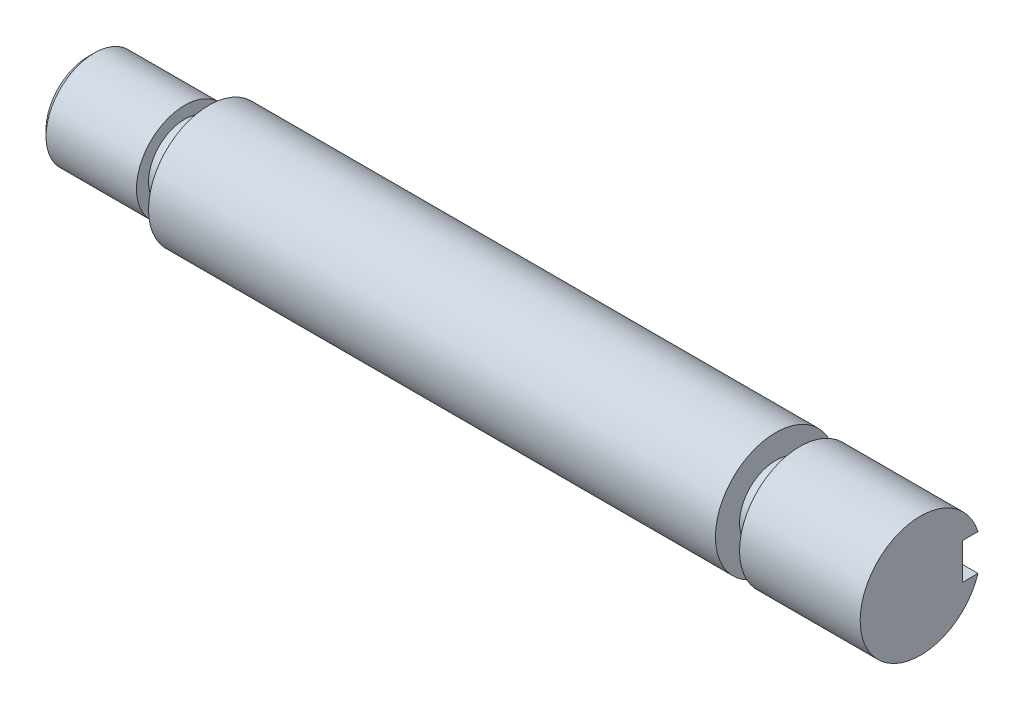
ISO-10303-21;
HEADER;
FILE_DESCRIPTION(('STEP AP214'),'2;1');
FILE_NAME('part.step','',(''),(''),'','','');
FILE_SCHEMA(('AUTOMOTIVE_DESIGN { 1 0 10303 214 1 1 1 1 }'));
ENDSEC;
DATA;
#1=APPLICATION_CONTEXT('core data for automotive mechanical design processes');
#2=APPLICATION_PROTOCOL_DEFINITION('international standard','automotive_design',2000,#1);
#3=PRODUCT_CONTEXT('',#1,'mechanical');
#4=PRODUCT('Part','Part','',(#3));
#5=PRODUCT_RELATED_PRODUCT_CATEGORY('part','',(#4));
#6=PRODUCT_DEFINITION_FORMATION('','',#4);
#7=PRODUCT_DEFINITION_CONTEXT('part definition',#1,'design');
#8=PRODUCT_DEFINITION('design','',#6,#7);
#9=PRODUCT_DEFINITION_SHAPE('','',#8);
#10=(LENGTH_UNIT() NAMED_UNIT(*) SI_UNIT(.MILLI.,.METRE.));
#11=(NAMED_UNIT(*) PLANE_ANGLE_UNIT() SI_UNIT($,.RADIAN.));
#12=(NAMED_UNIT(*) SI_UNIT($,.STERADIAN.) SOLID_ANGLE_UNIT());
#13=UNCERTAINTY_MEASURE_WITH_UNIT(LENGTH_MEASURE(1.E-05),#10,'distance_accuracy_value','');
#14=(GEOMETRIC_REPRESENTATION_CONTEXT(3) GLOBAL_UNCERTAINTY_ASSIGNED_CONTEXT((#13)) GLOBAL_UNIT_ASSIGNED_CONTEXT((#10,
#11,#12)) REPRESENTATION_CONTEXT('',''));
#15=CARTESIAN_POINT('',(0.,0.,0.));
#16=DIRECTION('',(0.,0.,1.));
#17=DIRECTION('',(1.,0.,0.));
#18=AXIS2_PLACEMENT_3D('',#15,#16,#17);
#19=CARTESIAN_POINT('',(34.5,0.,0.));
#20=DIRECTION('',(-1.,0.,0.));
#21=DIRECTION('',(0.,0.,1.));
#22=AXIS2_PLACEMENT_3D('',#19,#20,#21);
#23=CYLINDRICAL_SURFACE('',#22,5.);
#24=CARTESIAN_POINT('',(9.,1.5,-4.76969600708473));
#25=CARTESIAN_POINT('',(8.95882060709199,1.5000008535707,-4.76969249084934));
#26=CARTESIAN_POINT('',(8.91766195687388,1.49830317083427,-4.77022997000129));
#27=CARTESIAN_POINT('',(8.83565883790444,1.49153785660316,-4.77235095109999));
#28=CARTESIAN_POINT('',(8.79481430060511,1.48647098275841,-4.77393421787376));
#29=CARTESIAN_POINT('',(8.67340945904534,1.46630203689311,-4.78018490618873));
#30=CARTESIAN_POINT('',(8.59369360958363,1.44623120413662,-4.78635370384275));
#31=CARTESIAN_POINT('',(8.43896442161414,1.39353102315626,-4.80195952113208));
#32=CARTESIAN_POINT('',(8.36394944780192,1.36090607068203,-4.81139539670393));
#33=CARTESIAN_POINT('',(8.2204033184024,1.28407841117655,-4.83246571212052));
#34=CARTESIAN_POINT('',(8.15187520027157,1.23987031651226,-4.84410117434933));
#35=CARTESIAN_POINT('',(8.02113394400295,1.13964850658326,-4.86866835244721));
#36=CARTESIAN_POINT('',(7.9591563396566,1.08333433465208,-4.88162755412974));
#37=CARTESIAN_POINT('',(7.84536441610004,0.961138919873351,-4.90714811559049));
#38=CARTESIAN_POINT('',(7.79355181399695,0.895256063916345,-4.91970940785249));
#39=CARTESIAN_POINT('',(7.70053622968151,0.754109921315427,-4.94333239727705));
#40=CARTESIAN_POINT('',(7.65957481970205,0.678680819336256,-4.95435770971354));
#41=CARTESIAN_POINT('',(7.59101158838185,0.521621185505772,-4.97334469846208));
#42=CARTESIAN_POINT('',(7.56340632220572,0.439992259012925,-4.98130716463903));
#43=CARTESIAN_POINT('',(7.52312020089795,0.275324697874876,-4.99307639935002));
#44=CARTESIAN_POINT('',(7.51003514203026,0.192393125294252,-4.99699549276993));
#45=CARTESIAN_POINT('',(7.49788265863674,0.0254235719980797,-5.00063202022426));
#46=CARTESIAN_POINT('',(7.49881258029984,-0.0586141962423644,-5.00035024971471));
#47=CARTESIAN_POINT('',(7.514392908759,-0.222571599946019,-4.99569602566267));
#48=CARTESIAN_POINT('',(7.52860534497872,-0.302537145464643,-4.99145415509187));
#49=CARTESIAN_POINT('',(7.56963163523811,-0.458890052102027,-4.9795151369998));
#50=CARTESIAN_POINT('',(7.59644614945594,-0.535277225531999,-4.97181780846028));
#51=CARTESIAN_POINT('',(7.66221222164644,-0.683347815892218,-4.95365214926145));
#52=CARTESIAN_POINT('',(7.70130164435694,-0.754966006044144,-4.94315255692525));
#53=CARTESIAN_POINT('',(7.79039859004832,-0.890765529574422,-4.92049624651755));
#54=CARTESIAN_POINT('',(7.84040855947883,-0.954945191614597,-4.90833915735884));
#55=CARTESIAN_POINT('',(7.95219198808351,-1.07665450541275,-4.88311673571409));
#56=CARTESIAN_POINT('',(8.01434386376074,-1.13383351478034,-4.87003445449554));
#57=CARTESIAN_POINT('',(8.14749742342792,-1.23706769492487,-4.84484215114658));
#58=CARTESIAN_POINT('',(8.21850168036552,-1.28311962013078,-4.83273241337565));
#59=CARTESIAN_POINT('',(8.36828092844929,-1.36316407240863,-4.81077228795653));
#60=CARTESIAN_POINT('',(8.4471271795934,-1.39703006341135,-4.80094596245948));
#61=CARTESIAN_POINT('',(8.60972450398174,-1.45085886004699,-4.78495663653201));
#62=CARTESIAN_POINT('',(8.69346786071437,-1.47084293218036,-4.77878803475875));
#63=CARTESIAN_POINT('',(8.81499488907019,-1.4890120359008,-4.77314032325006));
#64=CARTESIAN_POINT('',(8.85189073417961,-1.49313202989009,-4.77185156275267));
#65=CARTESIAN_POINT('',(8.92585147909953,-1.49862355614854,-4.77012928611782));
#66=CARTESIAN_POINT('',(8.96291604966386,-1.49999912968269,-4.76969451246644));
#67=CARTESIAN_POINT('',(9.,-1.5,-4.76969600708473));
#68=B_SPLINE_CURVE_WITH_KNOTS('',3,(#24,#25,#26,#27,#28,#29,#30,#31,#32,#33,#34,#35,#36,#37,#38,
#39,#40,#41,#42,#43,#44,#45,#46,#47,#48,#49,#50,#51,#52,#53,#54,#55,#56,#57,#58,#59,#60,#61,#62,
#63,#64,#65,#66,#67),.UNSPECIFIED.,.F.,.F.,(4,2,2,2,2,2,2,2,2,2,2,2,2,2,2,2,2,2,2,2,2,4),(0.,
0.123459071219734,0.246890388853043,0.49291134961521,0.738846245884323,0.984895736828092,
1.23795510798803,1.49105719006936,1.74939356197455,2.00766326783256,2.25854751319802,
2.5093842528947,2.75223130012966,2.99509107067835,3.2407824256273,3.48652887757005,
3.74172568310981,3.99699683536777,4.25484698071527,4.51230123440207,4.62365084745809,
4.73483637253615),.UNSPECIFIED.);
#69=CARTESIAN_POINT('',(9.,1.5,-4.76969600708473));
#70=VERTEX_POINT('',#69);
#71=CARTESIAN_POINT('',(9.,-1.5,-4.76969600708473));
#72=VERTEX_POINT('',#71);
#73=EDGE_CURVE('E123',#70,#72,#68,.T.);
#74=ORIENTED_EDGE('',*,*,#73,.T.);
#75=DIRECTION('',(-1.,0.,0.));
#76=VECTOR('',#75,1.);
#77=CARTESIAN_POINT('',(34.5,-1.5,-4.76969600708473));
#78=LINE('',#77,#76);
#79=CARTESIAN_POINT('',(22.5,-1.5,-4.76969600708473));
#80=VERTEX_POINT('',#79);
#81=EDGE_CURVE('E171',#72,#80,#78,.F.);
#82=ORIENTED_EDGE('',*,*,#81,.T.);
#83=CARTESIAN_POINT('',(22.5,0.,0.));
#84=DIRECTION('',(1.,0.,0.));
#85=DIRECTION('',(0.,0.,-1.));
#86=AXIS2_PLACEMENT_3D('',#83,#84,#85);
#87=CIRCLE('',#86,5.);
#88=CARTESIAN_POINT('',(22.5,1.5,-4.76969600708473));
#89=VERTEX_POINT('',#88);
#90=EDGE_CURVE('E191',#89,#80,#87,.T.);
#91=ORIENTED_EDGE('',*,*,#90,.F.);
#92=DIRECTION('',(-1.,0.,0.));
#93=VECTOR('',#92,1.);
#94=CARTESIAN_POINT('',(34.5,1.5,-4.76969600708473));
#95=LINE('',#94,#93);
#96=EDGE_CURVE('E158',#89,#70,#95,.T.);
#97=ORIENTED_EDGE('',*,*,#96,.T.);
#98=EDGE_LOOP('',(#74,#82,#91,#97));
#99=FACE_BOUND('',#98,.T.);
#100=CARTESIAN_POINT('',(-24.5,0.,0.));
#101=DIRECTION('',(-1.,0.,0.));
#102=DIRECTION('',(0.,0.,1.));
#103=AXIS2_PLACEMENT_3D('',#100,#101,#102);
#104=CIRCLE('',#103,5.);
#105=CARTESIAN_POINT('',(-24.5,0.,5.));
#106=VERTEX_POINT('',#105);
#107=EDGE_CURVE('E52',#106,#106,#104,.T.);
#108=ORIENTED_EDGE('',*,*,#107,.F.);
#109=EDGE_LOOP('',(#108));
#110=FACE_BOUND('',#109,.T.);
#111=ADVANCED_FACE('F47',(#99,#110),#23,.T.);
#112=CARTESIAN_POINT('',(22.5,0.,0.));
#113=DIRECTION('',(1.,0.,0.));
#114=DIRECTION('',(0.,0.,-1.));
#115=AXIS2_PLACEMENT_3D('',#112,#113,#114);
#116=PLANE('',#115);
#117=DIRECTION('',(0.,0.,-1.));
#118=VECTOR('',#117,1.);
#119=CARTESIAN_POINT('',(22.5,-1.5,0.));
#120=LINE('',#119,#118);
#121=CARTESIAN_POINT('',(22.5,-1.5,-3.5));
#122=VERTEX_POINT('',#121);
#123=EDGE_CURVE('E168',#122,#80,#120,.T.);
#124=ORIENTED_EDGE('',*,*,#123,.F.);
#125=DIRECTION('',(0.,-1.,0.));
#126=VECTOR('',#125,1.);
#127=CARTESIAN_POINT('',(22.5,0.,-3.5));
#128=LINE('',#127,#126);
#129=CARTESIAN_POINT('',(22.5,1.5,-3.5));
#130=VERTEX_POINT('',#129);
#131=EDGE_CURVE('E179',#130,#122,#128,.T.);
#132=ORIENTED_EDGE('',*,*,#131,.F.);
#133=DIRECTION('',(0.,0.,1.));
#134=VECTOR('',#133,1.);
#135=CARTESIAN_POINT('',(22.5,1.5,0.));
#136=LINE('',#135,#134);
#137=EDGE_CURVE('E132',#89,#130,#136,.T.);
#138=ORIENTED_EDGE('',*,*,#137,.F.);
#139=ORIENTED_EDGE('',*,*,#90,.T.);
#140=EDGE_LOOP('',(#124,#132,#138,#139));
#141=FACE_BOUND('',#140,.T.);
#142=CARTESIAN_POINT('',(22.5,0.,0.));
#143=DIRECTION('',(1.,0.,0.));
#144=DIRECTION('',(0.,0.,-1.));
#145=AXIS2_PLACEMENT_3D('',#142,#143,#144);
#146=CIRCLE('',#145,3.);
#147=CARTESIAN_POINT('',(22.5,0.,-3.));
#148=VERTEX_POINT('',#147);
#149=EDGE_CURVE('E183',#148,#148,#146,.T.);
#150=ORIENTED_EDGE('',*,*,#149,.F.);
#151=EDGE_LOOP('',(#150));
#152=FACE_BOUND('',#151,.T.);
#153=ADVANCED_FACE('F238',(#141,#152),#116,.T.);
#154=CARTESIAN_POINT('',(24.5,0.,0.));
#155=DIRECTION('',(1.,0.,0.));
#156=DIRECTION('',(0.,0.,-1.));
#157=AXIS2_PLACEMENT_3D('',#154,#155,#156);
#158=PLANE('',#157);
#159=CARTESIAN_POINT('',(24.5,0.,0.));
#160=DIRECTION('',(1.,0.,0.));
#161=DIRECTION('',(0.,0.,-1.));
#162=AXIS2_PLACEMENT_3D('',#159,#160,#161);
#163=CIRCLE('',#162,3.);
#164=CARTESIAN_POINT('',(24.5,0.,-3.));
#165=VERTEX_POINT('',#164);
#166=EDGE_CURVE('E182',#165,#165,#163,.T.);
#167=ORIENTED_EDGE('',*,*,#166,.T.);
#168=EDGE_LOOP('',(#167));
#169=FACE_BOUND('',#168,.T.);
#170=DIRECTION('',(0.,-1.,0.));
#171=VECTOR('',#170,1.);
#172=CARTESIAN_POINT('',(24.5,0.,-3.5));
#173=LINE('',#172,#171);
#174=CARTESIAN_POINT('',(24.5,1.5,-3.5));
#175=VERTEX_POINT('',#174);
#176=CARTESIAN_POINT('',(24.5,-1.5,-3.5));
#177=VERTEX_POINT('',#176);
#178=EDGE_CURVE('E175',#175,#177,#173,.T.);
#179=ORIENTED_EDGE('',*,*,#178,.T.);
#180=DIRECTION('',(0.,0.,-1.));
#181=VECTOR('',#180,1.);
#182=CARTESIAN_POINT('',(24.5,-1.5,0.));
#183=LINE('',#182,#181);
#184=CARTESIAN_POINT('',(24.5,-1.5,-4.76969600708473));
#185=VERTEX_POINT('',#184);
#186=EDGE_CURVE('E164',#177,#185,#183,.T.);
#187=ORIENTED_EDGE('',*,*,#186,.T.);
#188=CARTESIAN_POINT('',(24.5,0.,0.));
#189=DIRECTION('',(1.,0.,0.));
#190=DIRECTION('',(0.,0.,-1.));
#191=AXIS2_PLACEMENT_3D('',#188,#189,#190);
#192=CIRCLE('',#191,5.);
#193=CARTESIAN_POINT('',(24.5,1.5,-4.76969600708473));
#194=VERTEX_POINT('',#193);
#195=EDGE_CURVE('E187',#194,#185,#192,.T.);
#196=ORIENTED_EDGE('',*,*,#195,.F.);
#197=DIRECTION('',(0.,0.,1.));
#198=VECTOR('',#197,1.);
#199=CARTESIAN_POINT('',(24.5,1.5,0.));
#200=LINE('',#199,#198);
#201=EDGE_CURVE('E73',#194,#175,#200,.T.);
#202=ORIENTED_EDGE('',*,*,#201,.T.);
#203=EDGE_LOOP('',(#179,#187,#196,#202));
#204=FACE_BOUND('',#203,.T.);
#205=ADVANCED_FACE('F236',(#169,#204),#158,.F.);
#206=CARTESIAN_POINT('',(22.5,0.,0.));
#207=DIRECTION('',(1.,0.,0.));
#208=DIRECTION('',(0.,0.,-1.));
#209=AXIS2_PLACEMENT_3D('',#206,#207,#208);
#210=CYLINDRICAL_SURFACE('',#209,3.);
#211=ORIENTED_EDGE('',*,*,#149,.T.);
#212=EDGE_LOOP('',(#211));
#213=FACE_BOUND('',#212,.T.);
#214=ORIENTED_EDGE('',*,*,#166,.F.);
#215=EDGE_LOOP('',(#214));
#216=FACE_BOUND('',#215,.T.);
#217=ADVANCED_FACE('F232',(#213,#216),#210,.T.);
#218=CARTESIAN_POINT('',(34.5,0.,0.));
#219=DIRECTION('',(1.,0.,0.));
#220=DIRECTION('',(0.,0.,-1.));
#221=AXIS2_PLACEMENT_3D('',#218,#219,#220);
#222=PLANE('',#221);
#223=DIRECTION('',(0.,0.,-1.));
#224=VECTOR('',#223,1.);
#225=CARTESIAN_POINT('',(34.5,-1.5,0.));
#226=LINE('',#225,#224);
#227=CARTESIAN_POINT('',(34.5,-1.5,-3.5));
#228=VERTEX_POINT('',#227);
#229=CARTESIAN_POINT('',(34.5,-1.5,-4.76969600708473));
#230=VERTEX_POINT('',#229);
#231=EDGE_CURVE('E161',#228,#230,#226,.T.);
#232=ORIENTED_EDGE('',*,*,#231,.F.);
#233=DIRECTION('',(0.,-1.,0.));
#234=VECTOR('',#233,1.);
#235=CARTESIAN_POINT('',(34.5,0.,-3.5));
#236=LINE('',#235,#234);
#237=CARTESIAN_POINT('',(34.5,1.5,-3.5));
#238=VERTEX_POINT('',#237);
#239=EDGE_CURVE('E209',#238,#228,#236,.T.);
#240=ORIENTED_EDGE('',*,*,#239,.F.);
#241=DIRECTION('',(0.,0.,1.));
#242=VECTOR('',#241,1.);
#243=CARTESIAN_POINT('',(34.5,1.5,0.));
#244=LINE('',#243,#242);
#245=CARTESIAN_POINT('',(34.5,1.5,-4.76969600708473));
#246=VERTEX_POINT('',#245);
#247=EDGE_CURVE('E150',#246,#238,#244,.T.);
#248=ORIENTED_EDGE('',*,*,#247,.F.);
#249=CARTESIAN_POINT('',(34.5,0.,0.));
#250=DIRECTION('',(1.,0.,0.));
#251=DIRECTION('',(0.,0.,-1.));
#252=AXIS2_PLACEMENT_3D('',#249,#250,#251);
#253=CIRCLE('',#252,5.);
#254=EDGE_CURVE('E195',#246,#230,#253,.T.);
#255=ORIENTED_EDGE('',*,*,#254,.T.);
#256=EDGE_LOOP('',(#232,#240,#248,#255));
#257=FACE_BOUND('',#256,.T.);
#258=ADVANCED_FACE('F235',(#257),#222,.T.);
#259=ORIENTED_EDGE('',*,*,#195,.T.);
#260=DIRECTION('',(-1.,0.,0.));
#261=VECTOR('',#260,1.);
#262=CARTESIAN_POINT('',(34.5,-1.5,-4.76969600708473));
#263=LINE('',#262,#261);
#264=EDGE_CURVE('E205',#185,#230,#263,.F.);
#265=ORIENTED_EDGE('',*,*,#264,.T.);
#266=ORIENTED_EDGE('',*,*,#254,.F.);
#267=DIRECTION('',(-1.,0.,0.));
#268=VECTOR('',#267,1.);
#269=CARTESIAN_POINT('',(34.5,1.5,-4.76969600708473));
#270=LINE('',#269,#268);
#271=EDGE_CURVE('E202',#246,#194,#270,.T.);
#272=ORIENTED_EDGE('',*,*,#271,.T.);
#273=EDGE_LOOP('',(#259,#265,#266,#272));
#274=FACE_BOUND('',#273,.T.);
#275=ADVANCED_FACE('F219',(#274),#23,.T.);
#276=CARTESIAN_POINT('',(68.4228979499015,-1.5,-6.7));
#277=DIRECTION('',(0.,-1.,0.));
#278=DIRECTION('',(0.,0.,-1.));
#279=AXIS2_PLACEMENT_3D('',#276,#277,#278);
#280=PLANE('',#279);
#281=DIRECTION('',(1.,0.,0.));
#282=VECTOR('',#281,1.);
#283=CARTESIAN_POINT('',(68.4228979499015,-1.5,-3.5));
#284=LINE('',#283,#282);
#285=EDGE_CURVE('E140',#177,#228,#284,.T.);
#286=ORIENTED_EDGE('',*,*,#285,.T.);
#287=ORIENTED_EDGE('',*,*,#231,.T.);
#288=ORIENTED_EDGE('',*,*,#264,.F.);
#289=ORIENTED_EDGE('',*,*,#186,.F.);
#290=EDGE_LOOP('',(#286,#287,#288,#289));
#291=FACE_BOUND('',#290,.T.);
#292=ADVANCED_FACE('F267',(#291),#280,.F.);
#293=CARTESIAN_POINT('',(68.4228979499015,1.5,-6.7));
#294=DIRECTION('',(0.,1.,0.));
#295=DIRECTION('',(0.,0.,1.));
#296=AXIS2_PLACEMENT_3D('',#293,#294,#295);
#297=PLANE('',#296);
#298=ORIENTED_EDGE('',*,*,#271,.F.);
#299=ORIENTED_EDGE('',*,*,#247,.T.);
#300=DIRECTION('',(-1.,0.,0.));
#301=VECTOR('',#300,1.);
#302=CARTESIAN_POINT('',(68.4228979499015,1.5,-3.5));
#303=LINE('',#302,#301);
#304=EDGE_CURVE('E135',#238,#175,#303,.T.);
#305=ORIENTED_EDGE('',*,*,#304,.T.);
#306=ORIENTED_EDGE('',*,*,#201,.F.);
#307=EDGE_LOOP('',(#298,#299,#305,#306));
#308=FACE_BOUND('',#307,.T.);
#309=ADVANCED_FACE('F231',(#308),#297,.F.);
#310=CARTESIAN_POINT('',(9.,0.,-3.5));
#311=DIRECTION('',(0.,0.,1.));
#312=DIRECTION('',(1.,0.,0.));
#313=AXIS2_PLACEMENT_3D('',#310,#311,#312);
#314=PLANE('',#313);
#315=ORIENTED_EDGE('',*,*,#304,.F.);
#316=ORIENTED_EDGE('',*,*,#239,.T.);
#317=ORIENTED_EDGE('',*,*,#285,.F.);
#318=ORIENTED_EDGE('',*,*,#178,.F.);
#319=EDGE_LOOP('',(#315,#316,#317,#318));
#320=FACE_BOUND('',#319,.T.);
#321=ADVANCED_FACE('F227',(#320),#314,.F.);
#322=CARTESIAN_POINT('',(9.,0.,-6.7));
#323=DIRECTION('',(0.,0.,1.));
#324=DIRECTION('',(1.,0.,0.));
#325=AXIS2_PLACEMENT_3D('',#322,#323,#324);
#326=CYLINDRICAL_SURFACE('',#325,1.5);
#327=DIRECTION('',(0.,0.,1.));
#328=VECTOR('',#327,1.);
#329=CARTESIAN_POINT('',(9.,1.5,-6.7));
#330=LINE('',#329,#328);
#331=CARTESIAN_POINT('',(9.,1.5,-3.5));
#332=VERTEX_POINT('',#331);
#333=EDGE_CURVE('E117',#70,#332,#330,.T.);
#334=ORIENTED_EDGE('',*,*,#333,.T.);
#335=CARTESIAN_POINT('',(9.,0.,-3.5));
#336=DIRECTION('',(0.,0.,1.));
#337=DIRECTION('',(1.,0.,0.));
#338=AXIS2_PLACEMENT_3D('',#335,#336,#337);
#339=CIRCLE('',#338,1.5);
#340=CARTESIAN_POINT('',(9.,-1.5,-3.5));
#341=VERTEX_POINT('',#340);
#342=EDGE_CURVE('E120',#332,#341,#339,.T.);
#343=ORIENTED_EDGE('',*,*,#342,.T.);
#344=DIRECTION('',(0.,0.,1.));
#345=VECTOR('',#344,1.);
#346=CARTESIAN_POINT('',(9.,-1.5,-6.7));
#347=LINE('',#346,#345);
#348=EDGE_CURVE('E127',#72,#341,#347,.T.);
#349=ORIENTED_EDGE('',*,*,#348,.F.);
#350=ORIENTED_EDGE('',*,*,#73,.F.);
#351=EDGE_LOOP('',(#334,#343,#349,#350));
#352=FACE_BOUND('',#351,.T.);
#353=ADVANCED_FACE('F118',(#352),#326,.F.);
#354=ORIENTED_EDGE('',*,*,#348,.T.);
#355=EDGE_CURVE('E128',#341,#122,#284,.T.);
#356=ORIENTED_EDGE('',*,*,#355,.T.);
#357=ORIENTED_EDGE('',*,*,#123,.T.);
#358=ORIENTED_EDGE('',*,*,#81,.F.);
#359=EDGE_LOOP('',(#354,#356,#357,#358));
#360=FACE_BOUND('',#359,.T.);
#361=ADVANCED_FACE('F226',(#360),#280,.F.);
#362=ORIENTED_EDGE('',*,*,#137,.T.);
#363=EDGE_CURVE('E65',#130,#332,#303,.T.);
#364=ORIENTED_EDGE('',*,*,#363,.T.);
#365=ORIENTED_EDGE('',*,*,#333,.F.);
#366=ORIENTED_EDGE('',*,*,#96,.F.);
#367=EDGE_LOOP('',(#362,#364,#365,#366));
#368=FACE_BOUND('',#367,.T.);
#369=ADVANCED_FACE('F130',(#368),#297,.F.);
#370=ORIENTED_EDGE('',*,*,#131,.T.);
#371=ORIENTED_EDGE('',*,*,#355,.F.);
#372=ORIENTED_EDGE('',*,*,#342,.F.);
#373=ORIENTED_EDGE('',*,*,#363,.F.);
#374=EDGE_LOOP('',(#370,#371,#372,#373));
#375=FACE_BOUND('',#374,.T.);
#376=ADVANCED_FACE('F137',(#375),#314,.F.);
#377=CARTESIAN_POINT('',(-24.5,0.,0.));
#378=DIRECTION('',(-1.,0.,0.));
#379=DIRECTION('',(0.,0.,1.));
#380=AXIS2_PLACEMENT_3D('',#377,#378,#379);
#381=PLANE('',#380);
#382=CARTESIAN_POINT('',(-24.5,0.,0.));
#383=DIRECTION('',(-1.,0.,0.));
#384=DIRECTION('',(0.,0.,1.));
#385=AXIS2_PLACEMENT_3D('',#382,#383,#384);
#386=CIRCLE('',#385,3.);
#387=CARTESIAN_POINT('',(-24.5,0.,3.));
#388=VERTEX_POINT('',#387);
#389=EDGE_CURVE('E313',#388,#388,#386,.T.);
#390=ORIENTED_EDGE('',*,*,#389,.F.);
#391=EDGE_LOOP('',(#390));
#392=FACE_BOUND('',#391,.T.);
#393=ORIENTED_EDGE('',*,*,#107,.T.);
#394=EDGE_LOOP('',(#393));
#395=FACE_BOUND('',#394,.T.);
#396=ADVANCED_FACE('F290',(#392,#395),#381,.T.);
#397=CARTESIAN_POINT('',(-26.5,0.,0.));
#398=DIRECTION('',(-1.,0.,0.));
#399=DIRECTION('',(0.,0.,1.));
#400=AXIS2_PLACEMENT_3D('',#397,#398,#399);
#401=PLANE('',#400);
#402=CARTESIAN_POINT('',(-26.5,0.,0.));
#403=DIRECTION('',(-1.,0.,0.));
#404=DIRECTION('',(0.,0.,1.));
#405=AXIS2_PLACEMENT_3D('',#402,#403,#404);
#406=CIRCLE('',#405,4.);
#407=CARTESIAN_POINT('',(-26.5,0.,4.));
#408=VERTEX_POINT('',#407);
#409=EDGE_CURVE('E311',#408,#408,#406,.F.);
#410=ORIENTED_EDGE('',*,*,#409,.T.);
#411=EDGE_LOOP('',(#410));
#412=FACE_BOUND('',#411,.T.);
#413=CARTESIAN_POINT('',(-26.5,0.,0.));
#414=DIRECTION('',(-1.,0.,0.));
#415=DIRECTION('',(0.,0.,1.));
#416=AXIS2_PLACEMENT_3D('',#413,#414,#415);
#417=CIRCLE('',#416,3.);
#418=CARTESIAN_POINT('',(-26.5,0.,3.));
#419=VERTEX_POINT('',#418);
#420=EDGE_CURVE('E318',#419,#419,#417,.T.);
#421=ORIENTED_EDGE('',*,*,#420,.T.);
#422=EDGE_LOOP('',(#421));
#423=FACE_BOUND('',#422,.T.);
#424=ADVANCED_FACE('F257',(#412,#423),#401,.F.);
#425=CARTESIAN_POINT('',(-24.5,0.,0.));
#426=DIRECTION('',(-1.,0.,0.));
#427=DIRECTION('',(0.,0.,1.));
#428=AXIS2_PLACEMENT_3D('',#425,#426,#427);
#429=CYLINDRICAL_SURFACE('',#428,3.);
#430=ORIENTED_EDGE('',*,*,#389,.T.);
#431=EDGE_LOOP('',(#430));
#432=FACE_BOUND('',#431,.T.);
#433=ORIENTED_EDGE('',*,*,#420,.F.);
#434=EDGE_LOOP('',(#433));
#435=FACE_BOUND('',#434,.T.);
#436=ADVANCED_FACE('F249',(#432,#435),#429,.T.);
#437=CARTESIAN_POINT('',(-34.5,0.,0.));
#438=DIRECTION('',(1.,0.,0.));
#439=DIRECTION('',(0.,0.,-1.));
#440=AXIS2_PLACEMENT_3D('',#437,#438,#439);
#441=PLANE('',#440);
#442=CARTESIAN_POINT('',(-34.5,0.,0.));
#443=DIRECTION('',(1.,0.,0.));
#444=DIRECTION('',(0.,0.,-1.));
#445=AXIS2_PLACEMENT_3D('',#442,#443,#444);
#446=CIRCLE('',#445,3.5);
#447=CARTESIAN_POINT('',(-34.5,0.,-3.5));
#448=VERTEX_POINT('',#447);
#449=EDGE_CURVE('E58',#448,#448,#446,.F.);
#450=ORIENTED_EDGE('',*,*,#449,.T.);
#451=EDGE_LOOP('',(#450));
#452=FACE_BOUND('',#451,.T.);
#453=ADVANCED_FACE('F247',(#452),#441,.F.);
#454=CARTESIAN_POINT('',(-34.5,0.,0.));
#455=DIRECTION('',(1.,0.,0.));
#456=DIRECTION('',(0.,0.,-1.));
#457=AXIS2_PLACEMENT_3D('',#454,#455,#456);
#458=CONICAL_SURFACE('',#457,3.5,0.785398163397445);
#459=CARTESIAN_POINT('',(-34.,0.,0.));
#460=DIRECTION('',(1.,0.,0.));
#461=DIRECTION('',(0.,0.,-1.));
#462=AXIS2_PLACEMENT_3D('',#459,#460,#461);
#463=CIRCLE('',#462,4.);
#464=CARTESIAN_POINT('',(-34.,0.,-4.));
#465=VERTEX_POINT('',#464);
#466=EDGE_CURVE('E12',#465,#465,#463,.T.);
#467=ORIENTED_EDGE('',*,*,#466,.F.);
#468=EDGE_LOOP('',(#467));
#469=FACE_BOUND('',#468,.T.);
#470=ORIENTED_EDGE('',*,*,#449,.F.);
#471=EDGE_LOOP('',(#470));
#472=FACE_BOUND('',#471,.T.);
#473=ADVANCED_FACE('F50',(#469,#472),#458,.T.);
#474=CARTESIAN_POINT('',(-26.5,0.,0.));
#475=DIRECTION('',(-1.,0.,0.));
#476=DIRECTION('',(0.,0.,1.));
#477=AXIS2_PLACEMENT_3D('',#474,#475,#476);
#478=CYLINDRICAL_SURFACE('',#477,4.);
#479=ORIENTED_EDGE('',*,*,#466,.T.);
#480=EDGE_LOOP('',(#479));
#481=FACE_BOUND('',#480,.T.);
#482=ORIENTED_EDGE('',*,*,#409,.F.);
#483=EDGE_LOOP('',(#482));
#484=FACE_BOUND('',#483,.T.);
#485=ADVANCED_FACE('F255',(#481,#484),#478,.T.);
#486=CLOSED_SHELL('',(#111,#153,#205,#217,#258,#275,#292,#309,#321,#353,#361,#369,#376,#396,
#424,#436,#453,#473,#485));
#487=MANIFOLD_SOLID_BREP('B2',#486);
#488=ADVANCED_BREP_SHAPE_REPRESENTATION('',(#18,#487),#14);
#489=SHAPE_DEFINITION_REPRESENTATION(#9,#488);
ENDSEC;
END-ISO-10303-21;
